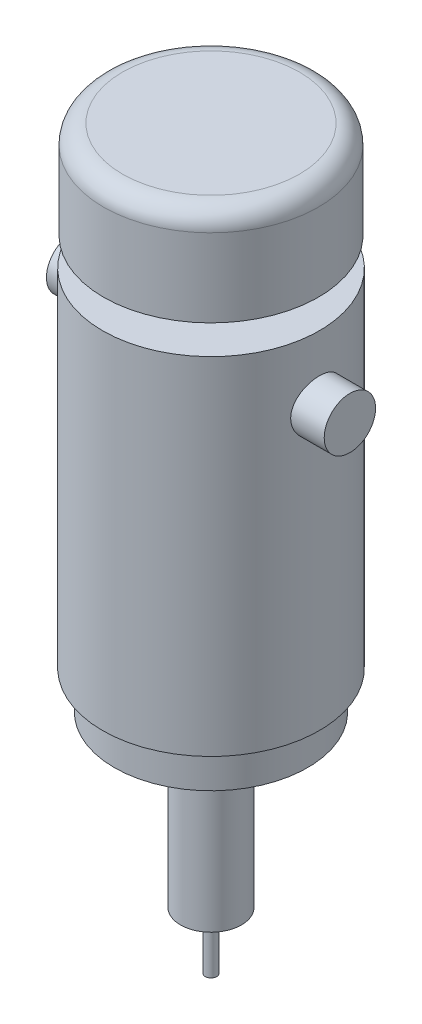
ISO-10303-21;
HEADER;
FILE_DESCRIPTION(('STEP AP214'),'2;1');
FILE_NAME('part.step','',(''),(''),'','','');
FILE_SCHEMA(('AUTOMOTIVE_DESIGN { 1 0 10303 214 1 1 1 1 }'));
ENDSEC;
DATA;
#1=APPLICATION_CONTEXT('core data for automotive mechanical design processes');
#2=APPLICATION_PROTOCOL_DEFINITION('international standard','automotive_design',2000,#1);
#3=PRODUCT_CONTEXT('',#1,'mechanical');
#4=PRODUCT('Part','Part','',(#3));
#5=PRODUCT_RELATED_PRODUCT_CATEGORY('part','',(#4));
#6=PRODUCT_DEFINITION_FORMATION('','',#4);
#7=PRODUCT_DEFINITION_CONTEXT('part definition',#1,'design');
#8=PRODUCT_DEFINITION('design','',#6,#7);
#9=PRODUCT_DEFINITION_SHAPE('','',#8);
#10=(LENGTH_UNIT() NAMED_UNIT(*) SI_UNIT(.MILLI.,.METRE.));
#11=(NAMED_UNIT(*) PLANE_ANGLE_UNIT() SI_UNIT($,.RADIAN.));
#12=(NAMED_UNIT(*) SI_UNIT($,.STERADIAN.) SOLID_ANGLE_UNIT());
#13=UNCERTAINTY_MEASURE_WITH_UNIT(LENGTH_MEASURE(1.E-05),#10,'distance_accuracy_value','');
#14=(GEOMETRIC_REPRESENTATION_CONTEXT(3) GLOBAL_UNCERTAINTY_ASSIGNED_CONTEXT((#13)) GLOBAL_UNIT_ASSIGNED_CONTEXT((#10,
#11,#12)) REPRESENTATION_CONTEXT('',''));
#15=CARTESIAN_POINT('',(0.,0.,0.));
#16=DIRECTION('',(0.,0.,1.));
#17=DIRECTION('',(1.,0.,0.));
#18=AXIS2_PLACEMENT_3D('',#15,#16,#17);
#19=CARTESIAN_POINT('',(0.,45.5,0.));
#20=DIRECTION('',(0.,-1.,0.));
#21=DIRECTION('',(0.,0.,-1.));
#22=AXIS2_PLACEMENT_3D('',#19,#20,#21);
#23=CYLINDRICAL_SURFACE('',#22,28.5);
#24=CARTESIAN_POINT('',(-27.6891224129621,28.5,6.75));
#25=CARTESIAN_POINT('',(-27.6891191847913,28.6867608504579,6.75000504378522));
#26=CARTESIAN_POINT('',(-27.6910152109063,28.8734647581406,6.74224752783215));
#27=CARTESIAN_POINT('',(-27.6985346249504,29.2455665199504,6.71129360422754));
#28=CARTESIAN_POINT('',(-27.7041584984566,29.4309642007527,6.68809518529324));
#29=CARTESIAN_POINT('',(-27.7189709861424,29.7991214225797,6.62643515286306));
#30=CARTESIAN_POINT('',(-27.7281609479414,29.9818799391551,6.58796776912264));
#31=CARTESIAN_POINT('',(-27.7498341222779,30.343467713213,6.49607071269532));
#32=CARTESIAN_POINT('',(-27.7623185512167,30.5222954928931,6.44263551305994));
#33=CARTESIAN_POINT('',(-27.7901897008424,30.8744275087021,6.32133044307713));
#34=CARTESIAN_POINT('',(-27.8055717478287,31.0477401214596,6.25348379543397));
#35=CARTESIAN_POINT('',(-27.8388142549302,31.3880389052552,6.10379367081407));
#36=CARTESIAN_POINT('',(-27.8566756299531,31.5550227117814,6.02194502429481));
#37=CARTESIAN_POINT('',(-27.8943605665458,31.8814388132141,5.84489798645614));
#38=CARTESIAN_POINT('',(-27.9141833810377,32.0408739493278,5.74970467217315));
#39=CARTESIAN_POINT('',(-27.9552551392796,32.3512949191772,5.54657079477483));
#40=CARTESIAN_POINT('',(-27.9765046169854,32.5022775501947,5.4386254473591));
#41=CARTESIAN_POINT('',(-28.0202218833795,32.7973239615887,5.20875099823115));
#42=CARTESIAN_POINT('',(-28.0427044554041,32.9412211783345,5.0866108711285));
#43=CARTESIAN_POINT('',(-28.0879213656135,33.2183178419304,4.83068941381041));
#44=CARTESIAN_POINT('',(-28.1106557941196,33.3515132996132,4.69690378099799));
#45=CARTESIAN_POINT('',(-28.1557341151129,33.606229083898,4.41865251725935));
#46=CARTESIAN_POINT('',(-28.1780781145045,33.7277526487296,4.27418986834221));
#47=CARTESIAN_POINT('',(-28.2217758507679,33.9583845068448,3.97544483248497));
#48=CARTESIAN_POINT('',(-28.2431292198085,34.0674882100213,3.82115884769323));
#49=CARTESIAN_POINT('',(-28.2845022502877,34.2737251840183,3.50187905367333));
#50=CARTESIAN_POINT('',(-28.3045022897905,34.3706948164281,3.33677692929532));
#51=CARTESIAN_POINT('',(-28.342309736294,34.5503501342738,2.9987330962159));
#52=CARTESIAN_POINT('',(-28.360117141615,34.6330358087667,2.8257913815086));
#53=CARTESIAN_POINT('',(-28.3930292772106,34.7834704792902,2.4733002010302));
#54=CARTESIAN_POINT('',(-28.4081343007968,34.8512210965303,2.29375145492785));
#55=CARTESIAN_POINT('',(-28.4352089615932,34.9712464212975,1.92931931812925));
#56=CARTESIAN_POINT('',(-28.4471785910953,35.0235210907784,1.74443591431944));
#57=CARTESIAN_POINT('',(-28.467445413664,35.1113343015055,1.37415133406958));
#58=CARTESIAN_POINT('',(-28.4758062877496,35.147163825575,1.18882264316874));
#59=CARTESIAN_POINT('',(-28.4889387622415,35.2031986642375,0.815627754909665));
#60=CARTESIAN_POINT('',(-28.4937091258763,35.2233985951969,0.627760705861755));
#61=CARTESIAN_POINT('',(-28.4995163849859,35.2479693426563,0.251014527217267));
#62=CARTESIAN_POINT('',(-28.5005550805562,35.2523477911861,0.0621359296246399));
#63=CARTESIAN_POINT('',(-28.4988825856431,35.2452777121029,-0.315327200924299));
#64=CARTESIAN_POINT('',(-28.4961700212238,35.2338233855815,-0.503911600797241));
#65=CARTESIAN_POINT('',(-28.4826643983848,35.1765549199108,-1.05947468743161));
#66=CARTESIAN_POINT('',(-28.4666198382589,35.108336954991,-1.42428658709192));
#67=CARTESIAN_POINT('',(-28.4220238086241,34.9134822707939,-2.13692445350196));
#68=CARTESIAN_POINT('',(-28.3934717139402,34.7868426313583,-2.48474957022045));
#69=CARTESIAN_POINT('',(-28.3266203888528,34.4776935851191,-3.15716141321857));
#70=CARTESIAN_POINT('',(-28.2882420972127,34.2947284472833,-3.48153090188046));
#71=CARTESIAN_POINT('',(-28.2059190180783,33.8784644741863,-4.09539195406306));
#72=CARTESIAN_POINT('',(-28.1619733526957,33.6451576967415,-4.38487800292996));
#73=CARTESIAN_POINT('',(-28.0720620388898,33.1281102864156,-4.92819413838896));
#74=CARTESIAN_POINT('',(-28.0260732590746,32.8432803066857,-5.1809848493183));
#75=CARTESIAN_POINT('',(-27.9382476854432,32.234789928071,-5.63542773909059));
#76=CARTESIAN_POINT('',(-27.8964110471798,31.9111280754209,-5.83707800248641));
#77=CARTESIAN_POINT('',(-27.8215525265652,31.2322801885233,-6.18409236052341));
#78=CARTESIAN_POINT('',(-27.788566288999,30.8769741335331,-6.32922987897513));
#79=CARTESIAN_POINT('',(-27.7356145199022,30.1460414741978,-6.55740449324334));
#80=CARTESIAN_POINT('',(-27.7156465222458,29.7704187331772,-6.64045335133626));
#81=CARTESIAN_POINT('',(-27.6915034940399,29.0190938102098,-6.74041834703399));
#82=CARTESIAN_POINT('',(-27.6869639499968,28.6436062280821,-6.75886119821564));
#83=CARTESIAN_POINT('',(-27.693203602137,27.894919930966,-6.73324915925586));
#84=CARTESIAN_POINT('',(-27.7039815469886,27.5217210315095,-6.68919937432596));
#85=CARTESIAN_POINT('',(-27.7392941682426,26.7937222234462,-6.54118921818965));
#86=CARTESIAN_POINT('',(-27.7636294615241,26.4387352736155,-6.43809656747362));
#87=CARTESIAN_POINT('',(-27.8231313849053,25.7510691735592,-6.17586469555943));
#88=CARTESIAN_POINT('',(-27.8582991940397,25.4183924564303,-6.01671937319486));
#89=CARTESIAN_POINT('',(-27.9362790042464,24.7782999921537,-5.64368595013822));
#90=CARTESIAN_POINT('',(-27.9792159436289,24.4714393783522,-5.42887374209454));
#91=CARTESIAN_POINT('',(-28.0676046462963,23.8974483965841,-4.95158394099663));
#92=CARTESIAN_POINT('',(-28.1130567779543,23.6303238695767,-4.6890993529667));
#93=CARTESIAN_POINT('',(-28.1799036823643,23.2622030543497,-4.26198648338669));
#94=CARTESIAN_POINT('',(-28.2022071741943,23.1437834623594,-4.11216896110042));
#95=CARTESIAN_POINT('',(-28.245565470181,22.9199906566838,-3.80294086264226));
#96=CARTESIAN_POINT('',(-28.2666207294215,22.8146126728265,-3.64353382587808));
#97=CARTESIAN_POINT('',(-28.3068975009052,22.6176319298881,-3.31613822712642));
#98=CARTESIAN_POINT('',(-28.3261183614161,22.5260340600474,-3.14814664749662));
#99=CARTESIAN_POINT('',(-28.3621681940819,22.3573726647385,-2.80484985967579));
#100=CARTESIAN_POINT('',(-28.3789981190193,22.2803033456494,-2.62954760100215));
#101=CARTESIAN_POINT('',(-28.4096920804208,22.1417264396028,-2.27398855791655));
#102=CARTESIAN_POINT('',(-28.4235749978914,22.0801192942662,-2.09377221357506));
#103=CARTESIAN_POINT('',(-28.4481152257464,21.9723269255248,-1.72864209091817));
#104=CARTESIAN_POINT('',(-28.4587737618846,21.9261358409886,-1.54373012670008));
#105=CARTESIAN_POINT('',(-28.4765668742944,21.849530022986,-1.17048921950605));
#106=CARTESIAN_POINT('',(-28.4837012873615,21.8191160201636,-0.982160118698858));
#107=CARTESIAN_POINT('',(-28.4942389744971,21.7743304897027,-0.603501735626342));
#108=CARTESIAN_POINT('',(-28.4976423255837,21.7599586309157,-0.413172494730601));
#109=CARTESIAN_POINT('',(-28.5005831107891,21.7475359299006,-0.036626031700083));
#110=CARTESIAN_POINT('',(-28.5002132298283,21.7490937953684,0.149577671700049));
#111=CARTESIAN_POINT('',(-28.4958393091579,21.7675829856694,0.521238976958716));
#112=CARTESIAN_POINT('',(-28.4918340858962,21.7845193172438,0.706696316072341));
#113=CARTESIAN_POINT('',(-28.4802996382086,21.8336265110547,1.07543132486653));
#114=CARTESIAN_POINT('',(-28.4727711375106,21.8657942445755,1.25870943426523));
#115=CARTESIAN_POINT('',(-28.4543972476775,21.9451003894391,1.62182864827332));
#116=CARTESIAN_POINT('',(-28.4435518158352,21.9922389935404,1.80166970859712));
#117=CARTESIAN_POINT('',(-28.4188925545496,22.1008799018089,2.15590792968894));
#118=CARTESIAN_POINT('',(-28.4050915275596,22.1623203528636,2.33032496696691));
#119=CARTESIAN_POINT('',(-28.3748691467876,22.2991815639466,2.6732803153288));
#120=CARTESIAN_POINT('',(-28.3584486548716,22.3745977269501,2.84182053787401));
#121=CARTESIAN_POINT('',(-28.3234125080485,22.5389063019702,3.17204802969639));
#122=CARTESIAN_POINT('',(-28.3047959268342,22.6278044051983,3.33373236779977));
#123=CARTESIAN_POINT('',(-28.2658704634284,22.8183955341793,3.64908254898053));
#124=CARTESIAN_POINT('',(-28.2455621467557,22.9200842899829,3.80275104390765));
#125=CARTESIAN_POINT('',(-28.2033151596192,23.1379892567723,4.10447743114843));
#126=CARTESIAN_POINT('',(-28.1813502989082,23.2544779316652,4.25233494630834));
#127=CARTESIAN_POINT('',(-28.1368097666925,23.4992957787265,4.53770753512976));
#128=CARTESIAN_POINT('',(-28.1142343074261,23.6276208731162,4.67522614124465));
#129=CARTESIAN_POINT('',(-28.0690691550132,23.8953760165901,4.93915954165859));
#130=CARTESIAN_POINT('',(-28.0464794614741,24.0348126999217,5.0655676061843));
#131=CARTESIAN_POINT('',(-28.0019308739025,24.3237579549754,5.30630295209518));
#132=CARTESIAN_POINT('',(-27.9799717533452,24.4732628435981,5.42063461231875));
#133=CARTESIAN_POINT('',(-27.9369315438618,24.7839934195288,5.63829522749147));
#134=CARTESIAN_POINT('',(-27.915871241289,24.9453731447727,5.74140856008218));
#135=CARTESIAN_POINT('',(-27.875651553265,25.2764253433438,5.9336068260744));
#136=CARTESIAN_POINT('',(-27.8564914692769,25.446094734824,6.02269692166514));
#137=CARTESIAN_POINT('',(-27.8206438583364,25.7925340466061,6.18617696995838));
#138=CARTESIAN_POINT('',(-27.8039551215476,25.9693004383708,6.2605741215139));
#139=CARTESIAN_POINT('',(-27.7735483306292,26.328690420832,6.39411315365567));
#140=CARTESIAN_POINT('',(-27.7598297883048,26.5113130432976,6.45325754156231));
#141=CARTESIAN_POINT('',(-27.7287802240214,26.9890817607243,6.58573050630009));
#142=CARTESIAN_POINT('',(-27.714004855903,27.2877661509404,6.64723059271349));
#143=CARTESIAN_POINT('',(-27.6941789098429,27.8910177222391,6.72935984812116));
#144=CARTESIAN_POINT('',(-27.6891276747994,28.195584504418,6.74999177875676));
#145=CARTESIAN_POINT('',(-27.6891224129621,28.5,6.75));
#146=B_SPLINE_CURVE_WITH_KNOTS('',3,(#24,#25,#26,#27,#28,#29,#30,#31,#32,#33,#34,#35,#36,#37,
#38,#39,#40,#41,#42,#43,#44,#45,#46,#47,#48,#49,#50,#51,#52,#53,#54,#55,#56,#57,#58,#59,#60,#61,
#62,#63,#64,#65,#66,#67,#68,#69,#70,#71,#72,#73,#74,#75,#76,#77,#78,#79,#80,#81,#82,#83,#84,#85,
#86,#87,#88,#89,#90,#91,#92,#93,#94,#95,#96,#97,#98,#99,#100,#101,#102,#103,#104,#105,#106,#107,
#108,#109,#110,#111,#112,#113,#114,#115,#116,#117,#118,#119,#120,#121,#122,#123,#124,#125,#126,
#127,#128,#129,#130,#131,#132,#133,#134,#135,#136,#137,#138,#139,#140,#141,#142,#143,#144,#145),
.UNSPECIFIED.,.T.,.F.,(4,2,2,2,2,2,2,2,2,2,2,2,2,2,2,2,2,2,2,2,2,2,2,2,2,2,2,2,2,2,2,2,2,2,2,2,
2,2,2,2,2,2,2,2,2,2,2,2,2,2,2,2,2,2,2,2,2,2,2,2,4),(0.,0.56001401500425,1.12010098992685,
1.68039982730916,2.24090583147975,2.80051539303247,3.36033201027794,3.91993621800613,
4.47975104851358,5.04932799134635,5.61911627297117,6.18874601410581,6.75858559900335,
7.33543015847845,7.91227515988062,8.489057513544,9.0658412851643,9.63198356426041,
10.198320765093,10.7643847374302,11.3306560911714,12.4393923107575,13.5481839555971,
14.6661937527924,15.7843800627084,16.9297832004783,18.0752292325785,19.2252215359622,
20.3749959258453,21.4974094384923,22.6197312630815,23.7259673499202,24.832323884494,
25.9583760339098,27.084593542814,27.6608223055766,28.2368396768207,28.8130609417966,
29.3890519358739,29.96123314808,30.5331965705461,31.1051864785389,31.6771645790625,
32.2351272344111,32.7932716098713,33.3513013853754,33.9093383461255,34.4650053148756,
35.0204898317157,35.5762094946134,36.131744129564,36.6996155557808,37.2672920695022,
37.8353100948481,38.4031214477736,38.9804149140674,39.557495369419,40.1342923771369,
40.710994507749,41.6238649757416,42.5366737549502),.UNSPECIFIED.);
#147=CARTESIAN_POINT('',(-27.6891224129621,28.5,6.75));
#148=VERTEX_POINT('',#147);
#149=EDGE_CURVE('E42',#148,#148,#146,.T.);
#150=ORIENTED_EDGE('',*,*,#149,.F.);
#151=EDGE_LOOP('',(#150));
#152=FACE_BOUND('',#151,.T.);
#153=CARTESIAN_POINT('',(0.,45.5,0.));
#154=DIRECTION('',(0.,1.,0.));
#155=DIRECTION('',(0.,0.,1.));
#156=AXIS2_PLACEMENT_3D('',#153,#154,#155);
#157=CIRCLE('',#156,28.5);
#158=CARTESIAN_POINT('',(0.,45.5,28.5));
#159=VERTEX_POINT('',#158);
#160=EDGE_CURVE('E134',#159,#159,#157,.T.);
#161=ORIENTED_EDGE('',*,*,#160,.F.);
#162=EDGE_LOOP('',(#161));
#163=FACE_BOUND('',#162,.T.);
#164=CARTESIAN_POINT('',(0.,-45.5,0.));
#165=DIRECTION('',(0.,1.,0.));
#166=DIRECTION('',(0.,0.,1.));
#167=AXIS2_PLACEMENT_3D('',#164,#165,#166);
#168=CIRCLE('',#167,28.5);
#169=CARTESIAN_POINT('',(0.,-45.5,28.5));
#170=VERTEX_POINT('',#169);
#171=EDGE_CURVE('E137',#170,#170,#168,.T.);
#172=ORIENTED_EDGE('',*,*,#171,.T.);
#173=EDGE_LOOP('',(#172));
#174=FACE_BOUND('',#173,.T.);
#175=CARTESIAN_POINT('',(27.6891224129621,28.5,6.75));
#176=CARTESIAN_POINT('',(27.6891191847913,28.3132391495421,6.75000504378522));
#177=CARTESIAN_POINT('',(27.6910152109063,28.1265352418594,6.74224752783215));
#178=CARTESIAN_POINT('',(27.6985346249504,27.7544334800496,6.71129360422754));
#179=CARTESIAN_POINT('',(27.7041584984566,27.5690357992473,6.68809518529324));
#180=CARTESIAN_POINT('',(27.7189709861424,27.2008785774203,6.62643515286306));
#181=CARTESIAN_POINT('',(27.7281609479414,27.0181200608449,6.58796776912264));
#182=CARTESIAN_POINT('',(27.7498341222779,26.6565322867869,6.49607071269532));
#183=CARTESIAN_POINT('',(27.7623185512167,26.4777045071069,6.44263551305994));
#184=CARTESIAN_POINT('',(27.7901897008424,26.1255724912979,6.32133044307713));
#185=CARTESIAN_POINT('',(27.8055717478287,25.9522598785404,6.25348379543397));
#186=CARTESIAN_POINT('',(27.8388142549302,25.6119610947448,6.10379367081407));
#187=CARTESIAN_POINT('',(27.8566756299531,25.4449772882186,6.02194502429481));
#188=CARTESIAN_POINT('',(27.8943605665458,25.1185611867859,5.84489798645614));
#189=CARTESIAN_POINT('',(27.9141833810377,24.9591260506722,5.74970467217314));
#190=CARTESIAN_POINT('',(27.9552551392796,24.6487050808228,5.54657079477483));
#191=CARTESIAN_POINT('',(27.9765046169854,24.4977224498053,5.4386254473591));
#192=CARTESIAN_POINT('',(28.0202218833795,24.2026760384113,5.20875099823115));
#193=CARTESIAN_POINT('',(28.0427044554041,24.0587788216655,5.0866108711285));
#194=CARTESIAN_POINT('',(28.0879213656135,23.7816821580696,4.83068941381041));
#195=CARTESIAN_POINT('',(28.1106557941196,23.6484867003868,4.69690378099798));
#196=CARTESIAN_POINT('',(28.1557341151129,23.393770916102,4.41865251725935));
#197=CARTESIAN_POINT('',(28.1780781145045,23.2722473512704,4.27418986834221));
#198=CARTESIAN_POINT('',(28.2217758507679,23.0416154931552,3.97544483248496));
#199=CARTESIAN_POINT('',(28.2431292198085,22.9325117899786,3.82115884769322));
#200=CARTESIAN_POINT('',(28.2845022502877,22.7262748159817,3.50187905367332));
#201=CARTESIAN_POINT('',(28.3045022897905,22.6293051835719,3.33677692929531));
#202=CARTESIAN_POINT('',(28.342309736294,22.4496498657261,2.99873309621589));
#203=CARTESIAN_POINT('',(28.360117141615,22.3669641912333,2.82579138150859));
#204=CARTESIAN_POINT('',(28.3930292772106,22.2165295207098,2.47330020103019));
#205=CARTESIAN_POINT('',(28.4081343007968,22.1487789034697,2.29375145492784));
#206=CARTESIAN_POINT('',(28.4352089615932,22.0287535787025,1.92931931812924));
#207=CARTESIAN_POINT('',(28.4471785910953,21.9764789092216,1.74443591431943));
#208=CARTESIAN_POINT('',(28.467445413664,21.8886656984945,1.37415133406957));
#209=CARTESIAN_POINT('',(28.4758062877496,21.852836174425,1.18882264316873));
#210=CARTESIAN_POINT('',(28.4889387622415,21.7968013357625,0.815627754909655));
#211=CARTESIAN_POINT('',(28.4937091258763,21.7766014048031,0.627760705861745));
#212=CARTESIAN_POINT('',(28.4995163849859,21.7520306573437,0.251014527217258));
#213=CARTESIAN_POINT('',(28.5005550805562,21.7476522088139,0.0621359296246303));
#214=CARTESIAN_POINT('',(28.4988825856431,21.7547222878971,-0.315327200924309));
#215=CARTESIAN_POINT('',(28.4961700212238,21.7661766144185,-0.503911600797251));
#216=CARTESIAN_POINT('',(28.4826643983848,21.8234450800892,-1.05947468743162));
#217=CARTESIAN_POINT('',(28.4666198382589,21.891663045009,-1.42428658709193));
#218=CARTESIAN_POINT('',(28.4220238086241,22.0865177292061,-2.13692445350197));
#219=CARTESIAN_POINT('',(28.3934717139402,22.2131573686417,-2.48474957022046));
#220=CARTESIAN_POINT('',(28.3266203888528,22.5223064148809,-3.15716141321858));
#221=CARTESIAN_POINT('',(28.2882420972127,22.7052715527167,-3.48153090188046));
#222=CARTESIAN_POINT('',(28.2059190180783,23.1215355258137,-4.09539195406307));
#223=CARTESIAN_POINT('',(28.1619733526957,23.3548423032585,-4.38487800292997));
#224=CARTESIAN_POINT('',(28.0720620388898,23.8718897135843,-4.92819413838896));
#225=CARTESIAN_POINT('',(28.0260732590746,24.1567196933143,-5.18098484931831));
#226=CARTESIAN_POINT('',(27.9382476854432,24.765210071929,-5.6354277390906));
#227=CARTESIAN_POINT('',(27.8964110471798,25.0888719245791,-5.83707800248641));
#228=CARTESIAN_POINT('',(27.8215525265652,25.7677198114767,-6.18409236052341));
#229=CARTESIAN_POINT('',(27.788566288999,26.1230258664669,-6.32922987897513));
#230=CARTESIAN_POINT('',(27.7356145199022,26.8539585258022,-6.55740449324334));
#231=CARTESIAN_POINT('',(27.7156465222458,27.2295812668228,-6.64045335133626));
#232=CARTESIAN_POINT('',(27.6915034940399,27.9809061897902,-6.74041834703399));
#233=CARTESIAN_POINT('',(27.6869639499969,28.3563937719179,-6.75886119821564));
#234=CARTESIAN_POINT('',(27.693203602137,29.105080069034,-6.73324915925586));
#235=CARTESIAN_POINT('',(27.7039815469886,29.4782789684905,-6.68919937432596));
#236=CARTESIAN_POINT('',(27.7392941682426,30.2062777765538,-6.54118921818965));
#237=CARTESIAN_POINT('',(27.7636294615241,30.5612647263845,-6.43809656747361));
#238=CARTESIAN_POINT('',(27.8231313849053,31.2489308264408,-6.17586469555943));
#239=CARTESIAN_POINT('',(27.8582991940397,31.5816075435697,-6.01671937319486));
#240=CARTESIAN_POINT('',(27.9362790042464,32.2217000078463,-5.64368595013822));
#241=CARTESIAN_POINT('',(27.9792159436289,32.5285606216478,-5.42887374209453));
#242=CARTESIAN_POINT('',(28.0676046462963,33.1025516034159,-4.95158394099662));
#243=CARTESIAN_POINT('',(28.1130567779543,33.3696761304233,-4.68909935296669));
#244=CARTESIAN_POINT('',(28.1799036823643,33.7377969456503,-4.26198648338669));
#245=CARTESIAN_POINT('',(28.2022071741943,33.8562165376406,-4.11216896110042));
#246=CARTESIAN_POINT('',(28.245565470181,34.0800093433162,-3.80294086264226));
#247=CARTESIAN_POINT('',(28.2666207294215,34.1853873271735,-3.64353382587808));
#248=CARTESIAN_POINT('',(28.3068975009052,34.3823680701119,-3.31613822712641));
#249=CARTESIAN_POINT('',(28.3261183614161,34.4739659399526,-3.14814664749662));
#250=CARTESIAN_POINT('',(28.3621681940819,34.6426273352615,-2.80484985967579));
#251=CARTESIAN_POINT('',(28.3789981190193,34.7196966543506,-2.62954760100214));
#252=CARTESIAN_POINT('',(28.4096920804208,34.8582735603972,-2.27398855791654));
#253=CARTESIAN_POINT('',(28.4235749978914,34.9198807057338,-2.09377221357505));
#254=CARTESIAN_POINT('',(28.4481152257464,35.0276730744752,-1.72864209091816));
#255=CARTESIAN_POINT('',(28.4587737618846,35.0738641590114,-1.54373012670008));
#256=CARTESIAN_POINT('',(28.4765668742944,35.150469977014,-1.17048921950604));
#257=CARTESIAN_POINT('',(28.4837012873615,35.1808839798364,-0.982160118698854));
#258=CARTESIAN_POINT('',(28.4942389744971,35.2256695102973,-0.603501735626338));
#259=CARTESIAN_POINT('',(28.4976423255837,35.2400413690843,-0.413172494730596));
#260=CARTESIAN_POINT('',(28.5005831107891,35.2524640700994,-0.0366260317000754));
#261=CARTESIAN_POINT('',(28.5002132298283,35.2509062046316,0.149577671700059));
#262=CARTESIAN_POINT('',(28.4958393091579,35.2324170143306,0.521238976958728));
#263=CARTESIAN_POINT('',(28.4918340858962,35.2154806827562,0.706696316072352));
#264=CARTESIAN_POINT('',(28.4802996382086,35.1663734889453,1.07543132486654));
#265=CARTESIAN_POINT('',(28.4727711375106,35.1342057554245,1.25870943426524));
#266=CARTESIAN_POINT('',(28.4543972476775,35.0548996105609,1.62182864827333));
#267=CARTESIAN_POINT('',(28.4435518158352,35.0077610064596,1.80166970859712));
#268=CARTESIAN_POINT('',(28.4188925545496,34.8991200981911,2.15590792968894));
#269=CARTESIAN_POINT('',(28.4050915275596,34.8376796471364,2.33032496696691));
#270=CARTESIAN_POINT('',(28.3748691467876,34.7008184360534,2.67328031532879));
#271=CARTESIAN_POINT('',(28.3584486548716,34.6254022730499,2.84182053787401));
#272=CARTESIAN_POINT('',(28.3234125080485,34.4610936980298,3.17204802969639));
#273=CARTESIAN_POINT('',(28.3047959268342,34.3721955948017,3.33373236779977));
#274=CARTESIAN_POINT('',(28.2658704634284,34.1816044658207,3.64908254898053));
#275=CARTESIAN_POINT('',(28.2455621467557,34.0799157100171,3.80275104390766));
#276=CARTESIAN_POINT('',(28.2033151596192,33.8620107432277,4.10447743114843));
#277=CARTESIAN_POINT('',(28.1813502989082,33.7455220683348,4.25233494630834));
#278=CARTESIAN_POINT('',(28.1368097666925,33.5007042212735,4.53770753512977));
#279=CARTESIAN_POINT('',(28.1142343074261,33.3723791268838,4.67522614124466));
#280=CARTESIAN_POINT('',(28.0690691550132,33.1046239834099,4.93915954165859));
#281=CARTESIAN_POINT('',(28.0464794614741,32.9651873000783,5.0655676061843));
#282=CARTESIAN_POINT('',(28.0019308739025,32.6762420450246,5.30630295209519));
#283=CARTESIAN_POINT('',(27.9799717533452,32.5267371564019,5.42063461231875));
#284=CARTESIAN_POINT('',(27.9369315438618,32.2160065804712,5.63829522749147));
#285=CARTESIAN_POINT('',(27.915871241289,32.0546268552273,5.74140856008218));
#286=CARTESIAN_POINT('',(27.875651553265,31.7235746566562,5.9336068260744));
#287=CARTESIAN_POINT('',(27.8564914692769,31.553905265176,6.02269692166514));
#288=CARTESIAN_POINT('',(27.8206438583364,31.2074659533939,6.18617696995838));
#289=CARTESIAN_POINT('',(27.8039551215476,31.0306995616292,6.2605741215139));
#290=CARTESIAN_POINT('',(27.7735483306292,30.671309579168,6.39411315365568));
#291=CARTESIAN_POINT('',(27.7598297883048,30.4886869567024,6.45325754156231));
#292=CARTESIAN_POINT('',(27.7287802240214,30.0109182392757,6.58573050630009));
#293=CARTESIAN_POINT('',(27.714004855903,29.7122338490596,6.6472305927135));
#294=CARTESIAN_POINT('',(27.6941789098429,29.1089822777609,6.72935984812116));
#295=CARTESIAN_POINT('',(27.6891276747994,28.804415495582,6.74999177875676));
#296=CARTESIAN_POINT('',(27.6891224129621,28.5,6.75));
#297=B_SPLINE_CURVE_WITH_KNOTS('',3,(#175,#176,#177,#178,#179,#180,#181,#182,#183,#184,#185,
#186,#187,#188,#189,#190,#191,#192,#193,#194,#195,#196,#197,#198,#199,#200,#201,#202,#203,#204,
#205,#206,#207,#208,#209,#210,#211,#212,#213,#214,#215,#216,#217,#218,#219,#220,#221,#222,#223,
#224,#225,#226,#227,#228,#229,#230,#231,#232,#233,#234,#235,#236,#237,#238,#239,#240,#241,#242,
#243,#244,#245,#246,#247,#248,#249,#250,#251,#252,#253,#254,#255,#256,#257,#258,#259,#260,#261,
#262,#263,#264,#265,#266,#267,#268,#269,#270,#271,#272,#273,#274,#275,#276,#277,#278,#279,#280,
#281,#282,#283,#284,#285,#286,#287,#288,#289,#290,#291,#292,#293,#294,#295,#296),.UNSPECIFIED.,
.T.,.F.,(4,2,2,2,2,2,2,2,2,2,2,2,2,2,2,2,2,2,2,2,2,2,2,2,2,2,2,2,2,2,2,2,2,2,2,2,2,2,2,2,2,2,2,
2,2,2,2,2,2,2,2,2,2,2,2,2,2,2,2,2,4),(0.,0.56001401500425,1.12010098992685,1.68039982730916,
2.24090583147975,2.80051539303247,3.36033201027795,3.91993621800613,4.47975104851359,
5.04932799134635,5.61911627297118,6.18874601410582,6.75858559900336,7.33543015847846,
7.91227515988063,8.48905751354401,9.0658412851643,9.63198356426042,10.198320765093,
10.7643847374302,11.3306560911714,12.4393923107575,13.5481839555971,14.6661937527924,
15.7843800627084,16.9297832004783,18.0752292325785,19.2252215359623,20.3749959258453,
21.4974094384923,22.6197312630815,23.7259673499203,24.832323884494,25.9583760339098,
27.084593542814,27.6608223055766,28.2368396768207,28.8130609417966,29.3890519358739,
29.96123314808,30.5331965705461,31.1051864785389,31.6771645790625,32.2351272344111,
32.7932716098713,33.3513013853754,33.9093383461255,34.4650053148756,35.0204898317157,
35.5762094946135,36.131744129564,36.6996155557808,37.2672920695023,37.8353100948481,
38.4031214477736,38.9804149140674,39.557495369419,40.1342923771369,40.710994507749,
41.6238649757417,42.5366737549502),.UNSPECIFIED.);
#298=CARTESIAN_POINT('',(27.6891224129621,28.5,6.75));
#299=VERTEX_POINT('',#298);
#300=EDGE_CURVE('E10',#299,#299,#297,.T.);
#301=ORIENTED_EDGE('',*,*,#300,.F.);
#302=EDGE_LOOP('',(#301));
#303=FACE_BOUND('',#302,.T.);
#304=ADVANCED_FACE('F32',(#152,#163,#174,#303),#23,.T.);
#305=CARTESIAN_POINT('',(0.,-100.,0.));
#306=DIRECTION('',(0.,-1.,0.));
#307=DIRECTION('',(0.,0.,-1.));
#308=AXIS2_PLACEMENT_3D('',#305,#306,#307);
#309=PLANE('',#308);
#310=CARTESIAN_POINT('',(0.,-100.,0.));
#311=DIRECTION('',(0.,-1.,0.));
#312=DIRECTION('',(0.,0.,-1.));
#313=AXIS2_PLACEMENT_3D('',#310,#311,#312);
#314=CIRCLE('',#313,8.);
#315=CARTESIAN_POINT('',(0.,-100.,-8.));
#316=VERTEX_POINT('',#315);
#317=EDGE_CURVE('E173',#316,#316,#314,.T.);
#318=ORIENTED_EDGE('',*,*,#317,.T.);
#319=EDGE_LOOP('',(#318));
#320=FACE_BOUND('',#319,.T.);
#321=CARTESIAN_POINT('',(0.,-100.,0.));
#322=DIRECTION('',(0.,-1.,0.));
#323=DIRECTION('',(0.,0.,-1.));
#324=AXIS2_PLACEMENT_3D('',#321,#322,#323);
#325=CIRCLE('',#324,1.5);
#326=CARTESIAN_POINT('',(0.,-100.,-1.5));
#327=VERTEX_POINT('',#326);
#328=EDGE_CURVE('E169',#327,#327,#325,.T.);
#329=ORIENTED_EDGE('',*,*,#328,.F.);
#330=EDGE_LOOP('',(#329));
#331=FACE_BOUND('',#330,.T.);
#332=ADVANCED_FACE('F93',(#320,#331),#309,.T.);
#333=CARTESIAN_POINT('',(0.,78.5,0.));
#334=DIRECTION('',(0.,-1.,0.));
#335=DIRECTION('',(0.,0.,-1.));
#336=AXIS2_PLACEMENT_3D('',#333,#334,#335);
#337=CYLINDRICAL_SURFACE('',#336,4.);
#338=CARTESIAN_POINT('',(0.,45.5,0.));
#339=DIRECTION('',(0.,1.,0.));
#340=DIRECTION('',(0.,0.,1.));
#341=AXIS2_PLACEMENT_3D('',#338,#339,#340);
#342=CIRCLE('',#341,4.);
#343=CARTESIAN_POINT('',(0.,45.5,4.));
#344=VERTEX_POINT('',#343);
#345=EDGE_CURVE('E162',#344,#344,#342,.T.);
#346=ORIENTED_EDGE('',*,*,#345,.T.);
#347=EDGE_LOOP('',(#346));
#348=FACE_BOUND('',#347,.T.);
#349=CARTESIAN_POINT('',(0.,53.,0.));
#350=DIRECTION('',(0.,1.,0.));
#351=DIRECTION('',(0.,0.,1.));
#352=AXIS2_PLACEMENT_3D('',#349,#350,#351);
#353=CIRCLE('',#352,4.);
#354=CARTESIAN_POINT('',(0.,53.,4.));
#355=VERTEX_POINT('',#354);
#356=EDGE_CURVE('E148',#355,#355,#353,.T.);
#357=ORIENTED_EDGE('',*,*,#356,.F.);
#358=EDGE_LOOP('',(#357));
#359=FACE_BOUND('',#358,.T.);
#360=ADVANCED_FACE('F89',(#348,#359),#337,.T.);
#361=CARTESIAN_POINT('',(0.,45.5,0.));
#362=DIRECTION('',(0.,1.,0.));
#363=DIRECTION('',(0.,0.,1.));
#364=AXIS2_PLACEMENT_3D('',#361,#362,#363);
#365=PLANE('',#364);
#366=ORIENTED_EDGE('',*,*,#160,.T.);
#367=EDGE_LOOP('',(#366));
#368=FACE_BOUND('',#367,.T.);
#369=ORIENTED_EDGE('',*,*,#345,.F.);
#370=EDGE_LOOP('',(#369));
#371=FACE_BOUND('',#370,.T.);
#372=ADVANCED_FACE('F92',(#368,#371),#365,.T.);
#373=CARTESIAN_POINT('',(0.,-58.,0.));
#374=DIRECTION('',(0.,-1.,0.));
#375=DIRECTION('',(0.,0.,-1.));
#376=AXIS2_PLACEMENT_3D('',#373,#374,#375);
#377=PLANE('',#376);
#378=CARTESIAN_POINT('',(0.,-58.,0.));
#379=DIRECTION('',(0.,-1.,0.));
#380=DIRECTION('',(0.,0.,-1.));
#381=AXIS2_PLACEMENT_3D('',#378,#379,#380);
#382=CIRCLE('',#381,12.65);
#383=CARTESIAN_POINT('',(0.,-58.,-12.65));
#384=VERTEX_POINT('',#383);
#385=EDGE_CURVE('E143',#384,#384,#382,.T.);
#386=ORIENTED_EDGE('',*,*,#385,.T.);
#387=EDGE_LOOP('',(#386));
#388=FACE_BOUND('',#387,.T.);
#389=CARTESIAN_POINT('',(0.,-58.,0.));
#390=DIRECTION('',(0.,-1.,0.));
#391=DIRECTION('',(0.,0.,-1.));
#392=AXIS2_PLACEMENT_3D('',#389,#390,#391);
#393=CIRCLE('',#392,8.);
#394=CARTESIAN_POINT('',(0.,-58.,-8.));
#395=VERTEX_POINT('',#394);
#396=EDGE_CURVE('E166',#395,#395,#393,.T.);
#397=ORIENTED_EDGE('',*,*,#396,.F.);
#398=EDGE_LOOP('',(#397));
#399=FACE_BOUND('',#398,.T.);
#400=ADVANCED_FACE('F102',(#388,#399),#377,.T.);
#401=CARTESIAN_POINT('',(0.,-55.5,0.));
#402=DIRECTION('',(0.,-1.,0.));
#403=DIRECTION('',(0.,0.,-1.));
#404=AXIS2_PLACEMENT_3D('',#401,#402,#403);
#405=PLANE('',#404);
#406=CARTESIAN_POINT('',(0.,-55.5,0.));
#407=DIRECTION('',(0.,-1.,0.));
#408=DIRECTION('',(0.,0.,-1.));
#409=AXIS2_PLACEMENT_3D('',#406,#407,#408);
#410=CIRCLE('',#409,25.4);
#411=CARTESIAN_POINT('',(0.,-55.5,-25.4));
#412=VERTEX_POINT('',#411);
#413=EDGE_CURVE('E138',#412,#412,#410,.T.);
#414=ORIENTED_EDGE('',*,*,#413,.T.);
#415=EDGE_LOOP('',(#414));
#416=FACE_BOUND('',#415,.T.);
#417=CARTESIAN_POINT('',(0.,-55.5,0.));
#418=DIRECTION('',(0.,-1.,0.));
#419=DIRECTION('',(0.,0.,-1.));
#420=AXIS2_PLACEMENT_3D('',#417,#418,#419);
#421=CIRCLE('',#420,12.65);
#422=CARTESIAN_POINT('',(0.,-55.5,-12.65));
#423=VERTEX_POINT('',#422);
#424=EDGE_CURVE('E176',#423,#423,#421,.T.);
#425=ORIENTED_EDGE('',*,*,#424,.F.);
#426=EDGE_LOOP('',(#425));
#427=FACE_BOUND('',#426,.T.);
#428=ADVANCED_FACE('F105',(#416,#427),#405,.T.);
#429=CARTESIAN_POINT('',(0.,-45.5,0.));
#430=DIRECTION('',(0.,1.,0.));
#431=DIRECTION('',(0.,0.,1.));
#432=AXIS2_PLACEMENT_3D('',#429,#430,#431);
#433=PLANE('',#432);
#434=ORIENTED_EDGE('',*,*,#171,.F.);
#435=EDGE_LOOP('',(#434));
#436=FACE_BOUND('',#435,.T.);
#437=CARTESIAN_POINT('',(0.,-45.5,0.));
#438=DIRECTION('',(0.,1.,0.));
#439=DIRECTION('',(0.,0.,1.));
#440=AXIS2_PLACEMENT_3D('',#437,#438,#439);
#441=CIRCLE('',#440,25.4);
#442=CARTESIAN_POINT('',(0.,-45.5,25.4));
#443=VERTEX_POINT('',#442);
#444=EDGE_CURVE('E140',#443,#443,#441,.F.);
#445=ORIENTED_EDGE('',*,*,#444,.F.);
#446=EDGE_LOOP('',(#445));
#447=FACE_BOUND('',#446,.T.);
#448=ADVANCED_FACE('F113',(#436,#447),#433,.F.);
#449=CARTESIAN_POINT('',(0.,-55.5,0.));
#450=DIRECTION('',(0.,1.,0.));
#451=DIRECTION('',(0.,0.,1.));
#452=AXIS2_PLACEMENT_3D('',#449,#450,#451);
#453=CYLINDRICAL_SURFACE('',#452,25.4);
#454=ORIENTED_EDGE('',*,*,#413,.F.);
#455=EDGE_LOOP('',(#454));
#456=FACE_BOUND('',#455,.T.);
#457=ORIENTED_EDGE('',*,*,#444,.T.);
#458=EDGE_LOOP('',(#457));
#459=FACE_BOUND('',#458,.T.);
#460=ADVANCED_FACE('F109',(#456,#459),#453,.T.);
#461=CARTESIAN_POINT('',(0.,-58.,0.));
#462=DIRECTION('',(0.,1.,0.));
#463=DIRECTION('',(0.,0.,1.));
#464=AXIS2_PLACEMENT_3D('',#461,#462,#463);
#465=CYLINDRICAL_SURFACE('',#464,12.65);
#466=ORIENTED_EDGE('',*,*,#385,.F.);
#467=EDGE_LOOP('',(#466));
#468=FACE_BOUND('',#467,.T.);
#469=ORIENTED_EDGE('',*,*,#424,.T.);
#470=EDGE_LOOP('',(#469));
#471=FACE_BOUND('',#470,.T.);
#472=ADVANCED_FACE('F100',(#468,#471),#465,.T.);
#473=CARTESIAN_POINT('',(0.,-100.,0.));
#474=DIRECTION('',(0.,1.,0.));
#475=DIRECTION('',(0.,0.,1.));
#476=AXIS2_PLACEMENT_3D('',#473,#474,#475);
#477=CYLINDRICAL_SURFACE('',#476,8.);
#478=ORIENTED_EDGE('',*,*,#317,.F.);
#479=EDGE_LOOP('',(#478));
#480=FACE_BOUND('',#479,.T.);
#481=ORIENTED_EDGE('',*,*,#396,.T.);
#482=EDGE_LOOP('',(#481));
#483=FACE_BOUND('',#482,.T.);
#484=ADVANCED_FACE('F80',(#480,#483),#477,.T.);
#485=CARTESIAN_POINT('',(0.,53.,0.));
#486=DIRECTION('',(0.,1.,0.));
#487=DIRECTION('',(0.,0.,1.));
#488=AXIS2_PLACEMENT_3D('',#485,#486,#487);
#489=PLANE('',#488);
#490=CARTESIAN_POINT('',(0.,53.,0.));
#491=DIRECTION('',(0.,1.,0.));
#492=DIRECTION('',(0.,0.,1.));
#493=AXIS2_PLACEMENT_3D('',#490,#491,#492);
#494=CIRCLE('',#493,28.25);
#495=CARTESIAN_POINT('',(0.,53.,28.25));
#496=VERTEX_POINT('',#495);
#497=EDGE_CURVE('E161',#496,#496,#494,.T.);
#498=ORIENTED_EDGE('',*,*,#497,.F.);
#499=EDGE_LOOP('',(#498));
#500=FACE_BOUND('',#499,.T.);
#501=ORIENTED_EDGE('',*,*,#356,.T.);
#502=EDGE_LOOP('',(#501));
#503=FACE_BOUND('',#502,.T.);
#504=ADVANCED_FACE('F76',(#500,#503),#489,.F.);
#505=CARTESIAN_POINT('',(0.,53.,0.));
#506=DIRECTION('',(0.,1.,0.));
#507=DIRECTION('',(0.,0.,1.));
#508=AXIS2_PLACEMENT_3D('',#505,#506,#507);
#509=CYLINDRICAL_SURFACE('',#508,28.25);
#510=CARTESIAN_POINT('',(0.,73.5,0.));
#511=DIRECTION('',(0.,1.,0.));
#512=DIRECTION('',(0.,0.,1.));
#513=AXIS2_PLACEMENT_3D('',#510,#511,#512);
#514=CIRCLE('',#513,28.25);
#515=CARTESIAN_POINT('',(0.,73.5,28.25));
#516=VERTEX_POINT('',#515);
#517=EDGE_CURVE('E46',#516,#516,#514,.F.);
#518=ORIENTED_EDGE('',*,*,#517,.T.);
#519=EDGE_LOOP('',(#518));
#520=FACE_BOUND('',#519,.T.);
#521=ORIENTED_EDGE('',*,*,#497,.T.);
#522=EDGE_LOOP('',(#521));
#523=FACE_BOUND('',#522,.T.);
#524=ADVANCED_FACE('F79',(#520,#523),#509,.T.);
#525=CARTESIAN_POINT('',(0.,78.5,0.));
#526=DIRECTION('',(0.,1.,0.));
#527=DIRECTION('',(0.,0.,1.));
#528=AXIS2_PLACEMENT_3D('',#525,#526,#527);
#529=PLANE('',#528);
#530=CARTESIAN_POINT('',(0.,78.5,0.));
#531=DIRECTION('',(0.,1.,0.));
#532=DIRECTION('',(0.,0.,1.));
#533=AXIS2_PLACEMENT_3D('',#530,#531,#532);
#534=CIRCLE('',#533,23.25);
#535=CARTESIAN_POINT('',(0.,78.5,23.25));
#536=VERTEX_POINT('',#535);
#537=EDGE_CURVE('E50',#536,#536,#534,.T.);
#538=ORIENTED_EDGE('',*,*,#537,.T.);
#539=EDGE_LOOP('',(#538));
#540=FACE_BOUND('',#539,.T.);
#541=ADVANCED_FACE('F84',(#540),#529,.T.);
#542=CARTESIAN_POINT('',(0.,73.5,0.));
#543=DIRECTION('',(0.,1.,0.));
#544=DIRECTION('',(0.,0.,1.));
#545=AXIS2_PLACEMENT_3D('',#542,#543,#544);
#546=TOROIDAL_SURFACE('',#545,23.25,5.);
#547=ORIENTED_EDGE('',*,*,#517,.F.);
#548=EDGE_LOOP('',(#547));
#549=FACE_BOUND('',#548,.T.);
#550=ORIENTED_EDGE('',*,*,#537,.F.);
#551=EDGE_LOOP('',(#550));
#552=FACE_BOUND('',#551,.T.);
#553=ADVANCED_FACE('F34',(#549,#552),#546,.T.);
#554=CARTESIAN_POINT('',(0.,-115.,0.));
#555=DIRECTION('',(0.,1.,0.));
#556=DIRECTION('',(0.,0.,1.));
#557=AXIS2_PLACEMENT_3D('',#554,#555,#556);
#558=CYLINDRICAL_SURFACE('',#557,1.5);
#559=CARTESIAN_POINT('',(0.,-115.,0.));
#560=DIRECTION('',(0.,-1.,0.));
#561=DIRECTION('',(0.,0.,-1.));
#562=AXIS2_PLACEMENT_3D('',#559,#560,#561);
#563=CIRCLE('',#562,1.5);
#564=CARTESIAN_POINT('',(0.,-115.,-1.5));
#565=VERTEX_POINT('',#564);
#566=EDGE_CURVE('E163',#565,#565,#563,.T.);
#567=ORIENTED_EDGE('',*,*,#566,.F.);
#568=EDGE_LOOP('',(#567));
#569=FACE_BOUND('',#568,.T.);
#570=ORIENTED_EDGE('',*,*,#328,.T.);
#571=EDGE_LOOP('',(#570));
#572=FACE_BOUND('',#571,.T.);
#573=ADVANCED_FACE('F71',(#569,#572),#558,.T.);
#574=CARTESIAN_POINT('',(0.,-115.,0.));
#575=DIRECTION('',(0.,-1.,0.));
#576=DIRECTION('',(0.,0.,-1.));
#577=AXIS2_PLACEMENT_3D('',#574,#575,#576);
#578=PLANE('',#577);
#579=ORIENTED_EDGE('',*,*,#566,.T.);
#580=EDGE_LOOP('',(#579));
#581=FACE_BOUND('',#580,.T.);
#582=ADVANCED_FACE('F67',(#581),#578,.T.);
#583=CARTESIAN_POINT('',(-36.5,28.5,0.));
#584=DIRECTION('',(1.,0.,0.));
#585=DIRECTION('',(0.,0.,-1.));
#586=AXIS2_PLACEMENT_3D('',#583,#584,#585);
#587=PLANE('',#586);
#588=CARTESIAN_POINT('',(-36.5,28.5,0.));
#589=DIRECTION('',(1.,0.,0.));
#590=DIRECTION('',(0.,0.,-1.));
#591=AXIS2_PLACEMENT_3D('',#588,#589,#590);
#592=CIRCLE('',#591,6.75);
#593=CARTESIAN_POINT('',(-36.5,28.5,-6.75));
#594=VERTEX_POINT('',#593);
#595=EDGE_CURVE('E196',#594,#594,#592,.T.);
#596=ORIENTED_EDGE('',*,*,#595,.F.);
#597=EDGE_LOOP('',(#596));
#598=FACE_BOUND('',#597,.T.);
#599=ADVANCED_FACE('F65',(#598),#587,.F.);
#600=CARTESIAN_POINT('',(36.5,28.5,0.));
#601=DIRECTION('',(-1.,0.,0.));
#602=DIRECTION('',(0.,0.,1.));
#603=AXIS2_PLACEMENT_3D('',#600,#601,#602);
#604=CYLINDRICAL_SURFACE('',#603,6.75);
#605=ORIENTED_EDGE('',*,*,#595,.T.);
#606=EDGE_LOOP('',(#605));
#607=FACE_BOUND('',#606,.T.);
#608=ORIENTED_EDGE('',*,*,#149,.T.);
#609=EDGE_LOOP('',(#608));
#610=FACE_BOUND('',#609,.T.);
#611=ADVANCED_FACE('F63',(#607,#610),#604,.T.);
#612=CARTESIAN_POINT('',(36.5,28.5,0.));
#613=DIRECTION('',(1.,0.,0.));
#614=DIRECTION('',(0.,0.,-1.));
#615=AXIS2_PLACEMENT_3D('',#612,#613,#614);
#616=CIRCLE('',#615,6.75);
#617=CARTESIAN_POINT('',(36.5,28.5,-6.75));
#618=VERTEX_POINT('',#617);
#619=EDGE_CURVE('E194',#618,#618,#616,.T.);
#620=ORIENTED_EDGE('',*,*,#619,.F.);
#621=EDGE_LOOP('',(#620));
#622=FACE_BOUND('',#621,.T.);
#623=ORIENTED_EDGE('',*,*,#300,.T.);
#624=EDGE_LOOP('',(#623));
#625=FACE_BOUND('',#624,.T.);
#626=ADVANCED_FACE('F57',(#622,#625),#604,.T.);
#627=CARTESIAN_POINT('',(36.5,28.5,0.));
#628=DIRECTION('',(1.,0.,0.));
#629=DIRECTION('',(0.,0.,-1.));
#630=AXIS2_PLACEMENT_3D('',#627,#628,#629);
#631=PLANE('',#630);
#632=ORIENTED_EDGE('',*,*,#619,.T.);
#633=EDGE_LOOP('',(#632));
#634=FACE_BOUND('',#633,.T.);
#635=ADVANCED_FACE('F62',(#634),#631,.T.);
#636=CLOSED_SHELL('',(#304,#332,#360,#372,#400,#428,#448,#460,#472,#484,#504,#524,#541,#553,
#573,#582,#599,#611,#626,#635));
#637=MANIFOLD_SOLID_BREP('B2',#636);
#638=ADVANCED_BREP_SHAPE_REPRESENTATION('',(#18,#637),#14);
#639=SHAPE_DEFINITION_REPRESENTATION(#9,#638);
ENDSEC;
END-ISO-10303-21;
